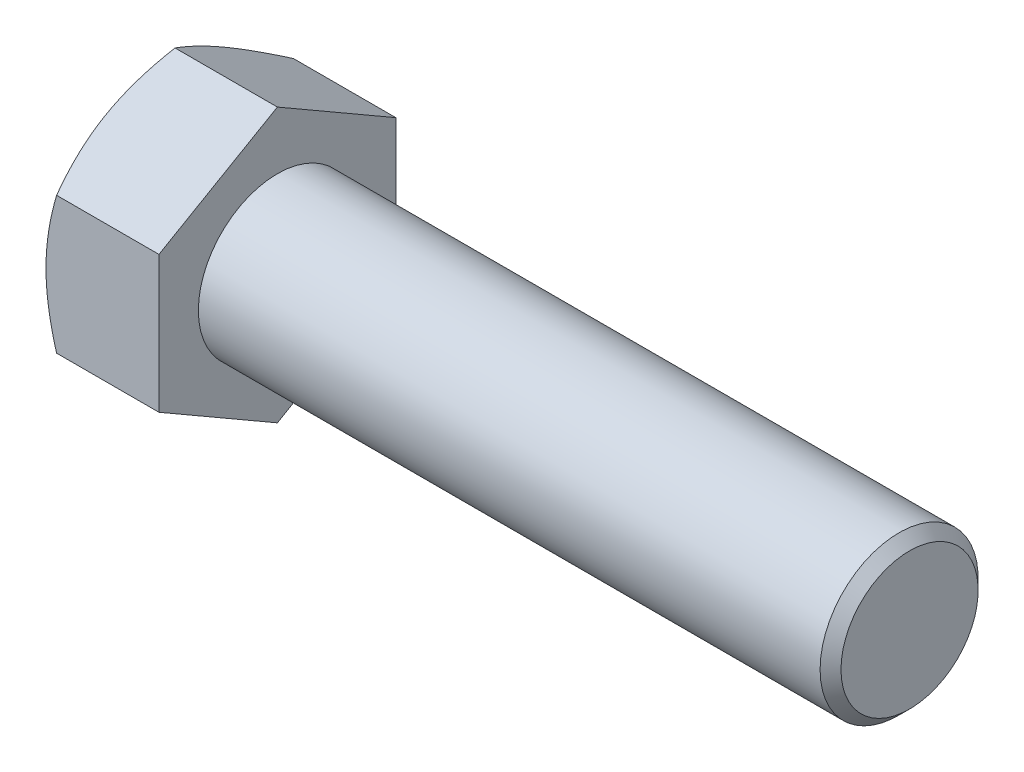
ISO-10303-21;
HEADER;
FILE_DESCRIPTION(('STEP AP214'),'2;1');
FILE_NAME('part.step','',(''),(''),'','','');
FILE_SCHEMA(('AUTOMOTIVE_DESIGN { 1 0 10303 214 1 1 1 1 }'));
ENDSEC;
DATA;
#1=APPLICATION_CONTEXT('core data for automotive mechanical design processes');
#2=APPLICATION_PROTOCOL_DEFINITION('international standard','automotive_design',2000,#1);
#3=PRODUCT_CONTEXT('',#1,'mechanical');
#4=PRODUCT('Part','Part','',(#3));
#5=PRODUCT_RELATED_PRODUCT_CATEGORY('part','',(#4));
#6=PRODUCT_DEFINITION_FORMATION('','',#4);
#7=PRODUCT_DEFINITION_CONTEXT('part definition',#1,'design');
#8=PRODUCT_DEFINITION('design','',#6,#7);
#9=PRODUCT_DEFINITION_SHAPE('','',#8);
#10=(LENGTH_UNIT() NAMED_UNIT(*) SI_UNIT(.MILLI.,.METRE.));
#11=(NAMED_UNIT(*) PLANE_ANGLE_UNIT() SI_UNIT($,.RADIAN.));
#12=(NAMED_UNIT(*) SI_UNIT($,.STERADIAN.) SOLID_ANGLE_UNIT());
#13=UNCERTAINTY_MEASURE_WITH_UNIT(LENGTH_MEASURE(1.E-05),#10,'distance_accuracy_value','');
#14=(GEOMETRIC_REPRESENTATION_CONTEXT(3) GLOBAL_UNCERTAINTY_ASSIGNED_CONTEXT((#13)) GLOBAL_UNIT_ASSIGNED_CONTEXT((#10,
#11,#12)) REPRESENTATION_CONTEXT('',''));
#15=CARTESIAN_POINT('',(0.,0.,0.));
#16=DIRECTION('',(0.,0.,1.));
#17=DIRECTION('',(1.,0.,0.));
#18=AXIS2_PLACEMENT_3D('',#15,#16,#17);
#19=CARTESIAN_POINT('',(6.8072,4.12077981131403,-7.1374));
#20=DIRECTION('',(0.,-0.866025403784438,0.500000000000001));
#21=DIRECTION('',(0.,-0.500000000000001,-0.866025403784438));
#22=AXIS2_PLACEMENT_3D('',#19,#20,#21);
#23=PLANE('',#22);
#24=CARTESIAN_POINT('',(0.637553523420348,8.24167509268191,0.000200000000000209));
#25=CARTESIAN_POINT('',(0.585265389565358,8.15109571898021,-0.15668807736911));
#26=CARTESIAN_POINT('',(0.535350289912886,8.06017862158373,-0.314161109336511));
#27=CARTESIAN_POINT('',(0.44091973939481,7.87760608276958,-0.63038602262945));
#28=CARTESIAN_POINT('',(0.396406617864103,7.78595034088604,-0.789138424377165));
#29=CARTESIAN_POINT('',(0.2718439466046,7.50951559742938,-1.26793744502137));
#30=CARTESIAN_POINT('',(0.200994122533561,7.32364541554993,-1.58987404364865));
#31=CARTESIAN_POINT('',(0.117914357261566,7.04549407114397,-2.07164630435335));
#32=CARTESIAN_POINT('',(0.0942473375753675,6.95404399131371,-2.23004248897558));
#33=CARTESIAN_POINT('',(0.0545611977075645,6.77073061920728,-2.54755056317072));
#34=CARTESIAN_POINT('',(0.0385414017966338,6.67886736416472,-2.70666238825308));
#35=CARTESIAN_POINT('',(0.0145579786669821,6.49498130931768,-3.02516237805154));
#36=CARTESIAN_POINT('',(0.00658520869042847,6.40295880983915,-3.18455002258784));
#37=CARTESIAN_POINT('',(-0.00114175893561545,6.21883388819856,-3.50346374180898));
#38=CARTESIAN_POINT('',(-0.000896210482461237,6.12673146859347,-3.66298981206503));
#39=CARTESIAN_POINT('',(0.0110730517201772,5.87440161908354,-4.10003793168242));
#40=CARTESIAN_POINT('',(0.0311658852990922,5.71425679021456,-4.37741691185292));
#41=CARTESIAN_POINT('',(0.0948800883359065,5.39503079963205,-4.93033254663833));
#42=CARTESIAN_POINT('',(0.13852323430896,5.23595076056063,-5.20586725678008));
#43=CARTESIAN_POINT('',(0.247618299095075,4.91608234409664,-5.75989560583231));
#44=CARTESIAN_POINT('',(0.31353243599271,4.75533432745402,-6.03831933787325));
#45=CARTESIAN_POINT('',(0.463130880450463,4.43623548204411,-6.59101475075978));
#46=CARTESIAN_POINT('',(0.546780048637372,4.27788056676996,-6.86529350964288));
#47=CARTESIAN_POINT('',(0.637553523420342,4.12066434126019,-7.1376));
#48=B_SPLINE_CURVE_WITH_KNOTS('',3,(#24,#25,#26,#27,#28,#29,#30,#31,#32,#33,#34,#35,#36,#37,#38,
#39,#40,#41,#42,#43,#44,#45,#46,#47),.UNSPECIFIED.,.F.,.F.,(4,2,2,2,2,2,2,2,2,2,2,4),(0.,
0.565616271543687,1.13147557690344,2.26554547664276,2.81869146049269,3.37178855781927,
3.9242565351942,4.4767074445971,5.43845614829341,6.40109569003607,7.3850851165131,
8.36714283329691),.UNSPECIFIED.);
#49=CARTESIAN_POINT('',(0.63748685535263,8.24155962262807,0.));
#50=VERTEX_POINT('',#49);
#51=CARTESIAN_POINT('',(0.,6.18116971697105,-3.56870000000001));
#52=VERTEX_POINT('',#51);
#53=EDGE_CURVE('E51',#50,#52,#48,.T.);
#54=ORIENTED_EDGE('',*,*,#53,.F.);
#55=DIRECTION('',(-1.,0.,0.));
#56=VECTOR('',#55,1.);
#57=CARTESIAN_POINT('',(6.8072,8.24155962262807,0.));
#58=LINE('',#57,#56);
#59=CARTESIAN_POINT('',(6.8072,8.24155962262807,0.));
#60=VERTEX_POINT('',#59);
#61=EDGE_CURVE('E147',#60,#50,#58,.T.);
#62=ORIENTED_EDGE('',*,*,#61,.F.);
#63=DIRECTION('',(0.,0.500000000000001,0.866025403784438));
#64=VECTOR('',#63,1.);
#65=CARTESIAN_POINT('',(6.8072,4.12077981131403,-7.1374));
#66=LINE('',#65,#64);
#67=CARTESIAN_POINT('',(6.8072,4.12077981131403,-7.1374));
#68=VERTEX_POINT('',#67);
#69=EDGE_CURVE('E232',#68,#60,#66,.T.);
#70=ORIENTED_EDGE('',*,*,#69,.F.);
#71=DIRECTION('',(-1.,0.,0.));
#72=VECTOR('',#71,1.);
#73=CARTESIAN_POINT('',(6.8072,4.12077981131403,-7.1374));
#74=LINE('',#73,#72);
#75=CARTESIAN_POINT('',(0.637486855352625,4.12077981131403,-7.1374));
#76=VERTEX_POINT('',#75);
#77=EDGE_CURVE('E135',#68,#76,#74,.T.);
#78=ORIENTED_EDGE('',*,*,#77,.T.);
#79=EDGE_CURVE('E129',#52,#76,#48,.T.);
#80=ORIENTED_EDGE('',*,*,#79,.F.);
#81=EDGE_LOOP('',(#54,#62,#70,#78,#80));
#82=FACE_BOUND('',#81,.T.);
#83=ADVANCED_FACE('F35',(#82),#23,.F.);
#84=CARTESIAN_POINT('',(6.8072,8.24155962262807,0.));
#85=DIRECTION('',(0.,-0.866025403784438,-0.500000000000001));
#86=DIRECTION('',(0.,0.500000000000001,-0.866025403784438));
#87=AXIS2_PLACEMENT_3D('',#84,#85,#86);
#88=PLANE('',#87);
#89=CARTESIAN_POINT('',(0.637553523420343,4.12066434126019,7.1376));
#90=CARTESIAN_POINT('',(0.585265389565355,4.21124371496189,6.98071192263089));
#91=CARTESIAN_POINT('',(0.535350289912882,4.30216081235838,6.82323889066349));
#92=CARTESIAN_POINT('',(0.440919739394807,4.48473335117252,6.50701397737055));
#93=CARTESIAN_POINT('',(0.396406617864099,4.57638909305607,6.34826157562283));
#94=CARTESIAN_POINT('',(0.271843946604595,4.85282383651273,5.86946255497863));
#95=CARTESIAN_POINT('',(0.200994122533558,5.03869401839218,5.54752595635135));
#96=CARTESIAN_POINT('',(0.117914357261565,5.31684536279814,5.06575369564664));
#97=CARTESIAN_POINT('',(0.0942473375753663,5.40829544262839,4.90735751102441));
#98=CARTESIAN_POINT('',(0.0545611977075638,5.59160881473483,4.58984943682928));
#99=CARTESIAN_POINT('',(0.0385414017966331,5.68347206977738,4.43073761174692));
#100=CARTESIAN_POINT('',(0.0145579786669819,5.86735812462442,4.11223762194845));
#101=CARTESIAN_POINT('',(0.0065852086904287,5.95938062410296,3.95284997741216));
#102=CARTESIAN_POINT('',(-0.00114175893561467,6.14350554574355,3.63393625819102));
#103=CARTESIAN_POINT('',(-0.000896210482460432,6.23560796534864,3.47441018793497));
#104=CARTESIAN_POINT('',(0.0110730517201783,6.48793781485856,3.03736206831758));
#105=CARTESIAN_POINT('',(0.0311658852990935,6.64808264372754,2.75998308814708));
#106=CARTESIAN_POINT('',(0.094880088335909,6.96730863431005,2.20706745336166));
#107=CARTESIAN_POINT('',(0.138523234308963,7.12638867338148,1.93153274321992));
#108=CARTESIAN_POINT('',(0.247618299095079,7.44625708984546,1.37750439416769));
#109=CARTESIAN_POINT('',(0.313532435992715,7.60700510648809,1.09908066212674));
#110=CARTESIAN_POINT('',(0.463130880450469,7.92610395189799,0.546385249240215));
#111=CARTESIAN_POINT('',(0.546780048637378,8.08445886717215,0.272106490357122));
#112=CARTESIAN_POINT('',(0.637553523420348,8.24167509268191,-0.000199999999999964));
#113=B_SPLINE_CURVE_WITH_KNOTS('',3,(#89,#90,#91,#92,#93,#94,#95,#96,#97,#98,#99,#100,#101,#102,
#103,#104,#105,#106,#107,#108,#109,#110,#111,#112),.UNSPECIFIED.,.F.,.F.,(4,2,2,2,2,2,2,2,2,2,2,
4),(0.,0.565616271543687,1.13147557690344,2.26554547664276,2.81869146049269,3.37178855781927,
3.92425653519419,4.4767074445971,5.4384561482934,6.40109569003607,7.3850851165131,
8.36714283329691),.UNSPECIFIED.);
#114=CARTESIAN_POINT('',(0.637486855352625,4.12077981131403,7.1374));
#115=VERTEX_POINT('',#114);
#116=CARTESIAN_POINT('',(0.,6.18116971697105,3.56870000000001));
#117=VERTEX_POINT('',#116);
#118=EDGE_CURVE('E58',#115,#117,#113,.T.);
#119=ORIENTED_EDGE('',*,*,#118,.F.);
#120=DIRECTION('',(-1.,0.,0.));
#121=VECTOR('',#120,1.);
#122=CARTESIAN_POINT('',(6.8072,4.12077981131403,7.1374));
#123=LINE('',#122,#121);
#124=CARTESIAN_POINT('',(6.8072,4.12077981131403,7.1374));
#125=VERTEX_POINT('',#124);
#126=EDGE_CURVE('E145',#125,#115,#123,.T.);
#127=ORIENTED_EDGE('',*,*,#126,.F.);
#128=DIRECTION('',(0.,-0.500000000000001,0.866025403784438));
#129=VECTOR('',#128,1.);
#130=CARTESIAN_POINT('',(6.8072,8.24155962262807,0.));
#131=LINE('',#130,#129);
#132=EDGE_CURVE('E230',#60,#125,#131,.T.);
#133=ORIENTED_EDGE('',*,*,#132,.F.);
#134=ORIENTED_EDGE('',*,*,#61,.T.);
#135=EDGE_CURVE('E162',#117,#50,#113,.T.);
#136=ORIENTED_EDGE('',*,*,#135,.F.);
#137=EDGE_LOOP('',(#119,#127,#133,#134,#136));
#138=FACE_BOUND('',#137,.T.);
#139=ADVANCED_FACE('F168',(#138),#88,.F.);
#140=CARTESIAN_POINT('',(6.8072,4.12077981131403,7.1374));
#141=DIRECTION('',(0.,0.,-1.));
#142=DIRECTION('',(0.,1.,0.));
#143=AXIS2_PLACEMENT_3D('',#140,#141,#142);
#144=PLANE('',#143);
#145=CARTESIAN_POINT('',(3.51793891529159,-11.1403587281823,7.1374));
#146=CARTESIAN_POINT('',(3.36611761423895,-10.8279722939829,7.1374));
#147=CARTESIAN_POINT('',(3.21573167495453,-10.5148763019502,7.1374));
#148=CARTESIAN_POINT('',(2.91863653187666,-9.88688803381041,7.1374));
#149=CARTESIAN_POINT('',(2.77192789413873,-9.57199549020356,7.1374));
#150=CARTESIAN_POINT('',(2.4822707444374,-8.93844907809395,7.1374));
#151=CARTESIAN_POINT('',(2.33934643073748,-8.61978410832043,7.1374));
#152=CARTESIAN_POINT('',(2.05925336355301,-7.97994405861169,7.1374));
#153=CARTESIAN_POINT('',(1.92208434263963,-7.65876909613177,7.1374));
#154=CARTESIAN_POINT('',(1.65065378260809,-7.00284865177262,7.1374));
#155=CARTESIAN_POINT('',(1.51663374093033,-6.66800268629788,7.1374));
#156=CARTESIAN_POINT('',(1.25856485309991,-5.99442084877243,7.1374));
#157=CARTESIAN_POINT('',(1.13451711552695,-5.65568454901975,7.1374));
#158=CARTESIAN_POINT('',(0.899596727822085,-4.97438980802078,7.1374));
#159=CARTESIAN_POINT('',(0.78869803686409,-4.63184044237924,7.1374));
#160=CARTESIAN_POINT('',(0.583585288687566,-3.94184101149602,7.1374));
#161=CARTESIAN_POINT('',(0.489366053520766,-3.59439250342775,7.1374));
#162=CARTESIAN_POINT('',(0.322585119794827,-2.89623643422075,7.1374));
#163=CARTESIAN_POINT('',(0.249906108269176,-2.54555766857316,7.1374));
#164=CARTESIAN_POINT('',(0.16016292785916,-2.01629019045635,7.1374));
#165=CARTESIAN_POINT('',(0.133459926539481,-1.839313958851,7.1374));
#166=CARTESIAN_POINT('',(0.0870009608477318,-1.48445773915166,7.1374));
#167=CARTESIAN_POINT('',(0.067244323557889,-1.30657784029349,7.1374));
#168=CARTESIAN_POINT('',(0.0353233928543425,-0.95250904258287,7.1374));
#169=CARTESIAN_POINT('',(0.0230620606309571,-0.776328928041973,7.1374));
#170=CARTESIAN_POINT('',(0.00600431658563445,-0.423607840316553,7.1374));
#171=CARTESIAN_POINT('',(0.00120777871187554,-0.247066873275855,7.1374));
#172=CARTESIAN_POINT('',(-0.000805707961562034,0.106061109907499,7.1374));
#173=CARTESIAN_POINT('',(0.00197740746879687,0.2826481264277,7.1374));
#174=CARTESIAN_POINT('',(0.0150543642613307,0.635545980840367,7.1374));
#175=CARTESIAN_POINT('',(0.0253485677574707,0.811856805005951,7.1374));
#176=CARTESIAN_POINT('',(0.0587173547474299,1.23335791950581,7.1374));
#177=CARTESIAN_POINT('',(0.085231710389993,1.4782818359211,7.1374));
#178=CARTESIAN_POINT('',(0.151325349035589,1.96634766571914,7.1374));
#179=CARTESIAN_POINT('',(0.190906343070057,2.20948934145904,7.1374));
#180=CARTESIAN_POINT('',(0.327153349422179,2.9359360870762,7.1374));
#181=CARTESIAN_POINT('',(0.441300495266762,3.41600789567279,7.1374));
#182=CARTESIAN_POINT('',(0.63974010589046,4.13409780442822,7.1374));
#183=CARTESIAN_POINT('',(0.711386839604792,4.37582478040939,7.1374));
#184=CARTESIAN_POINT('',(0.862240727229826,4.85693123571051,7.1374));
#185=CARTESIAN_POINT('',(0.941447936544226,5.09631069781354,7.1374));
#186=CARTESIAN_POINT('',(1.10614180650527,5.57279746366799,7.1374));
#187=CARTESIAN_POINT('',(1.19162653767747,5.80990544046864,7.1374));
#188=CARTESIAN_POINT('',(1.36785754635362,6.28214651213648,7.1374));
#189=CARTESIAN_POINT('',(1.45860372215422,6.51727964507674,7.1374));
#190=CARTESIAN_POINT('',(1.70099135929758,7.12822933761362,7.1374));
#191=CARTESIAN_POINT('',(1.85611245253595,7.50266378774822,7.1374));
#192=CARTESIAN_POINT('',(2.17492034843319,8.24788094351541,7.1374));
#193=CARTESIAN_POINT('',(2.3386079550759,8.61866330249801,7.1374));
#194=CARTESIAN_POINT('',(2.67260301760851,9.3573726984069,7.1374));
#195=CARTESIAN_POINT('',(2.8429126446277,9.72529875060164,7.1374));
#196=CARTESIAN_POINT('',(3.18863367867035,10.4587232716281,7.1374));
#197=CARTESIAN_POINT('',(3.36404491215601,10.8242218225161,7.1374));
#198=CARTESIAN_POINT('',(3.71915496685772,11.5537773356311,7.1374));
#199=CARTESIAN_POINT('',(3.8988595988184,11.9178314638411,7.1374));
#200=CARTESIAN_POINT('',(4.2615056849147,12.6443245258428,7.1374));
#201=CARTESIAN_POINT('',(4.44444716142806,13.006763448446,7.1374));
#202=CARTESIAN_POINT('',(4.81291716824558,13.7302353253808,7.1374));
#203=CARTESIAN_POINT('',(4.99844519887936,14.0912685344906,7.13739999999999));
#204=CARTESIAN_POINT('',(5.3716547110066,14.8122208157994,7.13739999999999));
#205=CARTESIAN_POINT('',(5.55933620097697,15.1721398836055,7.13739999999999));
#206=CARTESIAN_POINT('',(6.08751400336934,16.1789579531885,7.13739999999999));
#207=CARTESIAN_POINT('',(6.43000254426917,16.824811650422,7.13739999999999));
#208=CARTESIAN_POINT('',(7.11919785549648,18.1143032782298,7.13739999999999));
#209=CARTESIAN_POINT('',(7.46590484800224,18.7579410897869,7.13739999999999));
#210=CARTESIAN_POINT('',(8.16140637522349,20.0415314645091,7.13739999999999));
#211=CARTESIAN_POINT('',(8.51019123489486,20.6814892752524,7.13739999999999));
#212=CARTESIAN_POINT('',(9.21019417110812,21.9600146163643,7.13739999999999));
#213=CARTESIAN_POINT('',(9.56141207421098,22.5985822416526,7.13739999999999));
#214=CARTESIAN_POINT('',(9.91351913505246,23.236655568045,7.13739999999999));
#215=B_SPLINE_CURVE_WITH_KNOTS('',3,(#145,#146,#147,#148,#149,#150,#151,#152,#153,#154,#155,
#156,#157,#158,#159,#160,#161,#162,#163,#164,#165,#166,#167,#168,#169,#170,#171,#172,#173,#174,
#175,#176,#177,#178,#179,#180,#181,#182,#183,#184,#185,#186,#187,#188,#189,#190,#191,#192,#193,
#194,#195,#196,#197,#198,#199,#200,#201,#202,#203,#204,#205,#206,#207,#208,#209,#210,#211,#212,
#213,#214),.UNSPECIFIED.,.F.,.F.,(4,2,2,2,2,2,2,2,2,2,2,2,2,2,2,2,2,2,2,2,2,2,2,2,2,2,2,2,2,2,2,
2,2,2,4),(0.,1.04198883636395,2.08413709551114,3.1318378441555,4.17948985568116,
5.26137797327195,6.34338619404597,7.42321445109922,8.50270689759014,9.57620733213103,
10.1130307972433,10.6498022441137,11.1794683960432,11.7091256038406,12.2387872999709,
12.7684745345005,13.507123576735,14.2458693809173,15.7241255464457,16.4804246116249,
17.2367292194423,17.9928023328306,18.7488608362509,19.9645892623299,21.1804319922018,
22.3966767725898,23.6128802291005,24.8308351314584,26.048798457366,27.2665296706471,
28.4842656790576,30.6773737410147,32.8705978143892,35.0570894125082,37.2434267187956),.UNSPECIFIED.);
#216=CARTESIAN_POINT('',(0.637486855352626,-4.12077981131403,7.1374));
#217=VERTEX_POINT('',#216);
#218=CARTESIAN_POINT('',(0.,0.,7.1374));
#219=VERTEX_POINT('',#218);
#220=EDGE_CURVE('E242',#217,#219,#215,.T.);
#221=ORIENTED_EDGE('',*,*,#220,.F.);
#222=DIRECTION('',(-1.,0.,0.));
#223=VECTOR('',#222,1.);
#224=CARTESIAN_POINT('',(6.8072,-4.12077981131403,7.1374));
#225=LINE('',#224,#223);
#226=CARTESIAN_POINT('',(6.8072,-4.12077981131403,7.1374));
#227=VERTEX_POINT('',#226);
#228=EDGE_CURVE('E137',#227,#217,#225,.T.);
#229=ORIENTED_EDGE('',*,*,#228,.F.);
#230=DIRECTION('',(0.,-1.,0.));
#231=VECTOR('',#230,1.);
#232=CARTESIAN_POINT('',(6.8072,4.12077981131403,7.1374));
#233=LINE('',#232,#231);
#234=EDGE_CURVE('E226',#125,#227,#233,.T.);
#235=ORIENTED_EDGE('',*,*,#234,.F.);
#236=ORIENTED_EDGE('',*,*,#126,.T.);
#237=EDGE_CURVE('E184',#219,#115,#215,.T.);
#238=ORIENTED_EDGE('',*,*,#237,.F.);
#239=EDGE_LOOP('',(#221,#229,#235,#236,#238));
#240=FACE_BOUND('',#239,.T.);
#241=ADVANCED_FACE('F248',(#240),#144,.F.);
#242=CARTESIAN_POINT('',(6.8072,-8.24155962262809,0.));
#243=DIRECTION('',(0.,0.866025403784438,-0.500000000000002));
#244=DIRECTION('',(0.,0.500000000000002,0.866025403784438));
#245=AXIS2_PLACEMENT_3D('',#242,#243,#244);
#246=PLANE('',#245);
#247=CARTESIAN_POINT('',(0.637553523420355,-8.24167509268193,-0.000200000000000038));
#248=CARTESIAN_POINT('',(0.585265389565365,-8.15109571898022,0.15668807736911));
#249=CARTESIAN_POINT('',(0.535350289912893,-8.06017862158374,0.314161109336512));
#250=CARTESIAN_POINT('',(0.440919739394817,-7.87760608276959,0.630386022629451));
#251=CARTESIAN_POINT('',(0.396406617864109,-7.78595034088605,0.789138424377166));
#252=CARTESIAN_POINT('',(0.271843946604605,-7.50951559742939,1.26793744502137));
#253=CARTESIAN_POINT('',(0.200994122533566,-7.32364541554994,1.58987404364865));
#254=CARTESIAN_POINT('',(0.117914357261572,-7.04549407114398,2.07164630435336));
#255=CARTESIAN_POINT('',(0.0942473375753728,-6.95404399131372,2.23004248897559));
#256=CARTESIAN_POINT('',(0.0545611977075693,-6.77073061920728,2.54755056317072));
#257=CARTESIAN_POINT('',(0.0385414017966381,-6.67886736416473,2.70666238825308));
#258=CARTESIAN_POINT('',(0.0145579786669859,-6.49498130931769,3.02516237805155));
#259=CARTESIAN_POINT('',(0.00658520869043238,-6.40295880983916,3.18455002258785));
#260=CARTESIAN_POINT('',(-0.00114175893561158,-6.21883388819857,3.50346374180899));
#261=CARTESIAN_POINT('',(-0.000896210482457587,-6.12673146859347,3.66298981206503));
#262=CARTESIAN_POINT('',(0.0110730517201805,-5.87440161908355,4.10003793168243));
#263=CARTESIAN_POINT('',(0.0311658852990955,-5.71425679021457,4.37741691185293));
#264=CARTESIAN_POINT('',(0.0948800883359098,-5.39503079963205,4.93033254663834));
#265=CARTESIAN_POINT('',(0.138523234308963,-5.23595076056063,5.20586725678009));
#266=CARTESIAN_POINT('',(0.247618299095078,-4.91608234409664,5.75989560583231));
#267=CARTESIAN_POINT('',(0.313532435992713,-4.75533432745402,6.03831933787326));
#268=CARTESIAN_POINT('',(0.463130880450465,-4.43623548204411,6.59101475075978));
#269=CARTESIAN_POINT('',(0.546780048637373,-4.27788056676996,6.86529350964288));
#270=CARTESIAN_POINT('',(0.637553523420343,-4.12066434126019,7.1376));
#271=B_SPLINE_CURVE_WITH_KNOTS('',3,(#247,#248,#249,#250,#251,#252,#253,#254,#255,#256,#257,
#258,#259,#260,#261,#262,#263,#264,#265,#266,#267,#268,#269,#270),.UNSPECIFIED.,.F.,.F.,(4,2,2,
2,2,2,2,2,2,2,2,4),(0.,0.565616271543688,1.13147557690344,2.26554547664277,2.81869146049269,
3.37178855781928,3.92425653519421,4.47670744459711,5.43845614829342,6.40109569003608,
7.38508511651311,8.36714283329692),.UNSPECIFIED.);
#272=CARTESIAN_POINT('',(0.637486855352638,-8.24155962262809,0.));
#273=VERTEX_POINT('',#272);
#274=CARTESIAN_POINT('',(0.,-6.18116971697104,3.56870000000001));
#275=VERTEX_POINT('',#274);
#276=EDGE_CURVE('E170',#273,#275,#271,.T.);
#277=ORIENTED_EDGE('',*,*,#276,.F.);
#278=DIRECTION('',(-1.,0.,0.));
#279=VECTOR('',#278,1.);
#280=CARTESIAN_POINT('',(6.8072,-8.24155962262809,0.));
#281=LINE('',#280,#279);
#282=CARTESIAN_POINT('',(6.8072,-8.24155962262809,0.));
#283=VERTEX_POINT('',#282);
#284=EDGE_CURVE('E134',#283,#273,#281,.T.);
#285=ORIENTED_EDGE('',*,*,#284,.F.);
#286=DIRECTION('',(0.,-0.500000000000002,-0.866025403784438));
#287=VECTOR('',#286,1.);
#288=CARTESIAN_POINT('',(6.8072,-8.24155962262809,0.));
#289=LINE('',#288,#287);
#290=EDGE_CURVE('E224',#227,#283,#289,.T.);
#291=ORIENTED_EDGE('',*,*,#290,.F.);
#292=ORIENTED_EDGE('',*,*,#228,.T.);
#293=EDGE_CURVE('E172',#275,#217,#271,.T.);
#294=ORIENTED_EDGE('',*,*,#293,.F.);
#295=EDGE_LOOP('',(#277,#285,#291,#292,#294));
#296=FACE_BOUND('',#295,.T.);
#297=ADVANCED_FACE('F220',(#296),#246,.F.);
#298=CARTESIAN_POINT('',(6.8072,-4.12077981131405,-7.1374));
#299=DIRECTION('',(0.,0.866025403784438,0.500000000000001));
#300=DIRECTION('',(0.,-0.500000000000001,0.866025403784438));
#301=AXIS2_PLACEMENT_3D('',#298,#299,#300);
#302=PLANE('',#301);
#303=CARTESIAN_POINT('',(0.637553523420348,-4.12066434126021,-7.1376));
#304=CARTESIAN_POINT('',(0.585265389565358,-4.21124371496191,-6.98071192263089));
#305=CARTESIAN_POINT('',(0.535350289912886,-4.30216081235839,-6.82323889066349));
#306=CARTESIAN_POINT('',(0.440919739394811,-4.48473335117254,-6.50701397737055));
#307=CARTESIAN_POINT('',(0.396406617864104,-4.57638909305608,-6.34826157562283));
#308=CARTESIAN_POINT('',(0.271843946604602,-4.85282383651274,-5.86946255497863));
#309=CARTESIAN_POINT('',(0.200994122533564,-5.03869401839219,-5.54752595635135));
#310=CARTESIAN_POINT('',(0.117914357261571,-5.31684536279815,-5.06575369564664));
#311=CARTESIAN_POINT('',(0.0942473375753719,-5.4082954426284,-4.90735751102441));
#312=CARTESIAN_POINT('',(0.0545611977075697,-5.59160881473484,-4.58984943682928));
#313=CARTESIAN_POINT('',(0.0385414017966394,-5.6834720697774,-4.43073761174692));
#314=CARTESIAN_POINT('',(0.0145579786669886,-5.86735812462444,-4.11223762194845));
#315=CARTESIAN_POINT('',(0.00658520869043526,-5.95938062410297,-3.95284997741216));
#316=CARTESIAN_POINT('',(-0.00114175893560797,-6.14350554574356,-3.63393625819102));
#317=CARTESIAN_POINT('',(-0.000896210482453403,-6.23560796534865,-3.47441018793497));
#318=CARTESIAN_POINT('',(0.0110730517201859,-6.48793781485857,-3.03736206831757));
#319=CARTESIAN_POINT('',(0.0311658852991012,-6.64808264372756,-2.75998308814708));
#320=CARTESIAN_POINT('',(0.0948800883359163,-6.96730863431007,-2.20706745336166));
#321=CARTESIAN_POINT('',(0.13852323430897,-7.12638867338149,-1.93153274321991));
#322=CARTESIAN_POINT('',(0.247618299095086,-7.44625708984548,-1.37750439416769));
#323=CARTESIAN_POINT('',(0.313532435992722,-7.6070051064881,-1.09908066212674));
#324=CARTESIAN_POINT('',(0.463130880450476,-7.92610395189801,-0.546385249240215));
#325=CARTESIAN_POINT('',(0.546780048637385,-8.08445886717216,-0.272106490357122));
#326=CARTESIAN_POINT('',(0.637553523420355,-8.24167509268193,0.000200000000000375));
#327=B_SPLINE_CURVE_WITH_KNOTS('',3,(#303,#304,#305,#306,#307,#308,#309,#310,#311,#312,#313,
#314,#315,#316,#317,#318,#319,#320,#321,#322,#323,#324,#325,#326),.UNSPECIFIED.,.F.,.F.,(4,2,2,
2,2,2,2,2,2,2,2,4),(0.,0.565616271543687,1.13147557690344,2.26554547664276,2.81869146049269,
3.37178855781927,3.9242565351942,4.47670744459711,5.43845614829341,6.40109569003608,
7.3850851165131,8.36714283329691),.UNSPECIFIED.);
#328=CARTESIAN_POINT('',(0.63748685535263,-4.12077981131405,-7.1374));
#329=VERTEX_POINT('',#328);
#330=CARTESIAN_POINT('',(0.,-6.18116971697105,-3.56870000000001));
#331=VERTEX_POINT('',#330);
#332=EDGE_CURVE('E111',#329,#331,#327,.T.);
#333=ORIENTED_EDGE('',*,*,#332,.F.);
#334=DIRECTION('',(-1.,0.,0.));
#335=VECTOR('',#334,1.);
#336=CARTESIAN_POINT('',(6.8072,-4.12077981131405,-7.1374));
#337=LINE('',#336,#335);
#338=CARTESIAN_POINT('',(6.8072,-4.12077981131405,-7.1374));
#339=VERTEX_POINT('',#338);
#340=EDGE_CURVE('E125',#339,#329,#337,.T.);
#341=ORIENTED_EDGE('',*,*,#340,.F.);
#342=DIRECTION('',(0.,0.500000000000001,-0.866025403784438));
#343=VECTOR('',#342,1.);
#344=CARTESIAN_POINT('',(6.8072,-4.12077981131405,-7.1374));
#345=LINE('',#344,#343);
#346=EDGE_CURVE('E222',#283,#339,#345,.T.);
#347=ORIENTED_EDGE('',*,*,#346,.F.);
#348=ORIENTED_EDGE('',*,*,#284,.T.);
#349=EDGE_CURVE('E128',#331,#273,#327,.T.);
#350=ORIENTED_EDGE('',*,*,#349,.F.);
#351=EDGE_LOOP('',(#333,#341,#347,#348,#350));
#352=FACE_BOUND('',#351,.T.);
#353=ADVANCED_FACE('F123',(#352),#302,.F.);
#354=CARTESIAN_POINT('',(6.8072,4.12077981131403,-7.1374));
#355=DIRECTION('',(0.,0.,1.));
#356=DIRECTION('',(1.,0.,0.));
#357=AXIS2_PLACEMENT_3D('',#354,#355,#356);
#358=PLANE('',#357);
#359=CARTESIAN_POINT('',(3.51793891464088,-11.1403587268438,-7.1374));
#360=CARTESIAN_POINT('',(3.36611761361543,-10.8279722926893,-7.1374));
#361=CARTESIAN_POINT('',(3.21573167435818,-10.5148763007017,-7.1374));
#362=CARTESIAN_POINT('',(2.91863653133453,-9.88688803265221,-7.1374));
#363=CARTESIAN_POINT('',(2.77192789362365,-9.57199548909056,-7.1374));
#364=CARTESIAN_POINT('',(2.48227074397642,-8.93844907707205,-7.1374));
#365=CARTESIAN_POINT('',(2.33934643030356,-8.61978410734443,-7.1374));
#366=CARTESIAN_POINT('',(2.05925336317276,-7.97994405772781,-7.1374));
#367=CARTESIAN_POINT('',(1.92208434228598,-7.65876909529411,-7.1374));
#368=CARTESIAN_POINT('',(1.65065378230838,-7.00284865103087,-7.1374));
#369=CARTESIAN_POINT('',(1.51663374065788,-6.66800268560586,-7.1374));
#370=CARTESIAN_POINT('',(1.25856485288052,-5.99442084818067,-7.1374));
#371=CARTESIAN_POINT('',(1.13451711533335,-5.65568454847852,-7.1374));
#372=CARTESIAN_POINT('',(0.899596727677598,-4.97438980758157,-7.1374));
#373=CARTESIAN_POINT('',(0.788698036742925,-4.6318404419915,-7.1374));
#374=CARTESIAN_POINT('',(0.58358528860922,-3.94184101121262,-7.1374));
#375=CARTESIAN_POINT('',(0.489366053461919,-3.59439250319721,-7.1374));
#376=CARTESIAN_POINT('',(0.322585119775293,-2.8962364341233,-7.1374));
#377=CARTESIAN_POINT('',(0.249906108267926,-2.54555766855629,-7.1374));
#378=CARTESIAN_POINT('',(0.160162927876228,-2.01629019056176,-7.1374));
#379=CARTESIAN_POINT('',(0.133459926561136,-1.8393139589974,-7.1374));
#380=CARTESIAN_POINT('',(0.0870009608751871,-1.48445773938036,-7.1374));
#381=CARTESIAN_POINT('',(0.0672443235865587,-1.30657784056351,-7.1374));
#382=CARTESIAN_POINT('',(0.0353233928817916,-0.952509042934685,-7.1374));
#383=CARTESIAN_POINT('',(0.0230620606560368,-0.776328928434256,-7.1374));
#384=CARTESIAN_POINT('',(0.00600431660240766,-0.423607840789684,-7.1374));
#385=CARTESIAN_POINT('',(0.00120777872271161,-0.247066873789368,-7.1374));
#386=CARTESIAN_POINT('',(-0.000805707966081502,0.106061109313529,-7.1374));
#387=CARTESIAN_POINT('',(0.0019774074548583,0.282648125793653,-7.1374));
#388=CARTESIAN_POINT('',(0.0150543642253239,0.635545980126694,-7.1374));
#389=CARTESIAN_POINT('',(0.0253485677088145,0.811856804252727,-7.1374));
#390=CARTESIAN_POINT('',(0.0587173546676609,1.23335791869125,-7.1374));
#391=CARTESIAN_POINT('',(0.0852317102922971,1.47828183508493,-7.1374));
#392=CARTESIAN_POINT('',(0.151325348901076,1.96634766484072,-7.1374));
#393=CARTESIAN_POINT('',(0.190906342916654,2.20948934055998,-7.1374));
#394=CARTESIAN_POINT('',(0.327153349211703,2.93593608611633,-7.1374));
#395=CARTESIAN_POINT('',(0.441300495017728,3.41600789467395,-7.1374));
#396=CARTESIAN_POINT('',(0.639740105584508,4.13409780337109,-7.1374));
#397=CARTESIAN_POINT('',(0.711386839279734,4.37582477933241,-7.1374));
#398=CARTESIAN_POINT('',(0.862240726867132,4.85693123459406,-7.1374));
#399=CARTESIAN_POINT('',(0.941447936163,5.09631069667747,-7.1374));
#400=CARTESIAN_POINT('',(1.10614180608763,5.57279746249282,-7.1374));
#401=CARTESIAN_POINT('',(1.19162653724196,5.80990543927398,-7.1374));
#402=CARTESIAN_POINT('',(1.36785754588296,6.28214651090285,-7.1374));
#403=CARTESIAN_POINT('',(1.4586037216663,6.51727964382363,-7.1374));
#404=CARTESIAN_POINT('',(1.70099135878085,7.1282293363487,-7.1374));
#405=CARTESIAN_POINT('',(1.85611245200931,7.50266378649047,-7.1374));
#406=CARTESIAN_POINT('',(2.17492034788946,8.2478809422711,-7.1374));
#407=CARTESIAN_POINT('',(2.33860795452499,8.61866330125997,-7.1374));
#408=CARTESIAN_POINT('',(2.67260301704526,9.35737269718074,-7.1374));
#409=CARTESIAN_POINT('',(2.8429126440593,9.72529874938109,-7.1374));
#410=CARTESIAN_POINT('',(3.18863367809308,10.4587232704181,-7.1374));
#411=CARTESIAN_POINT('',(3.36404491157502,10.8242218213112,-7.1374));
#412=CARTESIAN_POINT('',(3.7191549662705,11.553777334436,-7.1374));
#413=CARTESIAN_POINT('',(3.89885959822867,11.9178314626509,-7.1374));
#414=CARTESIAN_POINT('',(4.26150568432078,12.6443245246618,-7.1374));
#415=CARTESIAN_POINT('',(4.44444716083244,13.0067634472695,-7.1374));
#416=CARTESIAN_POINT('',(4.81291716764717,13.7302353242129,-7.1374));
#417=CARTESIAN_POINT('',(4.99844519827985,14.0912685333268,-7.1374));
#418=CARTESIAN_POINT('',(5.37165471040538,14.8122208146436,-7.1374));
#419=CARTESIAN_POINT('',(5.55933620037513,15.1721398824536,-7.1374));
#420=CARTESIAN_POINT('',(6.08751400276292,16.1789579520409,-7.1374));
#421=CARTESIAN_POINT('',(6.43000254365915,16.8248116492745,-7.1374));
#422=CARTESIAN_POINT('',(7.11919785487999,18.1143032770824,-7.1374));
#423=CARTESIAN_POINT('',(7.46590484738288,18.7579410886393,-7.1374));
#424=CARTESIAN_POINT('',(8.16140637459832,20.0415314633598,-7.1374));
#425=CARTESIAN_POINT('',(8.51019123426675,20.6814892741017,-7.1374));
#426=CARTESIAN_POINT('',(9.21019417047446,21.9600146152104,-7.1374));
#427=CARTESIAN_POINT('',(9.56141207357472,22.598582240497,-7.1374));
#428=CARTESIAN_POINT('',(9.9135191344137,23.2366555668876,-7.1374));
#429=B_SPLINE_CURVE_WITH_KNOTS('',3,(#359,#360,#361,#362,#363,#364,#365,#366,#367,#368,#369,
#370,#371,#372,#373,#374,#375,#376,#377,#378,#379,#380,#381,#382,#383,#384,#385,#386,#387,#388,
#389,#390,#391,#392,#393,#394,#395,#396,#397,#398,#399,#400,#401,#402,#403,#404,#405,#406,#407,
#408,#409,#410,#411,#412,#413,#414,#415,#416,#417,#418,#419,#420,#421,#422,#423,#424,#425,#426,
#427,#428),.UNSPECIFIED.,.F.,.F.,(4,2,2,2,2,2,2,2,2,2,2,2,2,2,2,2,2,2,2,2,2,2,2,2,2,2,2,2,2,2,2,
2,2,2,4),(0.,1.0419888362068,2.08413709519682,3.13183784368231,4.17948985504911,
5.26137797247103,6.34338619307611,7.42321444996099,8.50270689628369,9.57620733057733,
10.113030795566,10.6498022423129,11.179468394122,11.7091256017988,12.2387872978086,
12.7684745322176,13.507123574382,14.245869378494,15.7241255438818,16.4804246089875,
17.2367292167316,17.9928023300467,18.7488608333938,19.9645892594812,21.1804319893616,
22.3966767697582,23.6128802262777,24.8308351286452,26.0487984545625,27.2665296678531,
28.4842656762731,30.6773737382256,32.8705978115956,35.0570894097065,37.2434267159856),.UNSPECIFIED.);
#430=CARTESIAN_POINT('',(0.,0.,-7.1374));
#431=VERTEX_POINT('',#430);
#432=EDGE_CURVE('E117',#76,#431,#429,.F.);
#433=ORIENTED_EDGE('',*,*,#432,.F.);
#434=ORIENTED_EDGE('',*,*,#77,.F.);
#435=DIRECTION('',(0.,1.,0.));
#436=VECTOR('',#435,1.);
#437=CARTESIAN_POINT('',(6.8072,4.12077981131403,-7.1374));
#438=LINE('',#437,#436);
#439=EDGE_CURVE('E133',#339,#68,#438,.T.);
#440=ORIENTED_EDGE('',*,*,#439,.F.);
#441=ORIENTED_EDGE('',*,*,#340,.T.);
#442=EDGE_CURVE('E108',#431,#329,#429,.F.);
#443=ORIENTED_EDGE('',*,*,#442,.F.);
#444=EDGE_LOOP('',(#433,#434,#440,#441,#443));
#445=FACE_BOUND('',#444,.T.);
#446=ADVANCED_FACE('F131',(#445),#358,.F.);
#447=CARTESIAN_POINT('',(6.8072,8.24155962262808,0.));
#448=DIRECTION('',(1.,0.,0.));
#449=DIRECTION('',(0.,0.,-1.));
#450=AXIS2_PLACEMENT_3D('',#447,#448,#449);
#451=PLANE('',#450);
#452=ORIENTED_EDGE('',*,*,#69,.T.);
#453=ORIENTED_EDGE('',*,*,#132,.T.);
#454=ORIENTED_EDGE('',*,*,#234,.T.);
#455=ORIENTED_EDGE('',*,*,#290,.T.);
#456=ORIENTED_EDGE('',*,*,#346,.T.);
#457=ORIENTED_EDGE('',*,*,#439,.T.);
#458=EDGE_LOOP('',(#452,#453,#454,#455,#456,#457));
#459=FACE_BOUND('',#458,.T.);
#460=CARTESIAN_POINT('',(6.8072,0.,0.));
#461=DIRECTION('',(1.,0.,0.));
#462=DIRECTION('',(0.,0.,-1.));
#463=AXIS2_PLACEMENT_3D('',#460,#461,#462);
#464=CIRCLE('',#463,4.7625);
#465=CARTESIAN_POINT('',(6.8072,0.,-4.7625));
#466=VERTEX_POINT('',#465);
#467=EDGE_CURVE('E235',#466,#466,#464,.F.);
#468=ORIENTED_EDGE('',*,*,#467,.T.);
#469=EDGE_LOOP('',(#468));
#470=FACE_BOUND('',#469,.T.);
#471=ADVANCED_FACE('F250',(#459,#470),#451,.T.);
#472=CARTESIAN_POINT('',(0.,0.,0.));
#473=DIRECTION('',(-1.,0.,0.));
#474=DIRECTION('',(0.,0.,1.));
#475=AXIS2_PLACEMENT_3D('',#472,#473,#474);
#476=CYLINDRICAL_SURFACE('',#475,4.7625);
#477=ORIENTED_EDGE('',*,*,#467,.F.);
#478=EDGE_LOOP('',(#477));
#479=FACE_BOUND('',#478,.T.);
#480=CARTESIAN_POINT('',(44.27728,0.,0.));
#481=DIRECTION('',(-1.,0.,0.));
#482=DIRECTION('',(0.,0.,1.));
#483=AXIS2_PLACEMENT_3D('',#480,#481,#482);
#484=CIRCLE('',#483,4.7625);
#485=CARTESIAN_POINT('',(44.27728,0.,4.7625));
#486=VERTEX_POINT('',#485);
#487=EDGE_CURVE('E238',#486,#486,#484,.T.);
#488=ORIENTED_EDGE('',*,*,#487,.T.);
#489=EDGE_LOOP('',(#488));
#490=FACE_BOUND('',#489,.T.);
#491=ADVANCED_FACE('F282',(#479,#490),#476,.T.);
#492=CARTESIAN_POINT('',(44.9072,0.,0.));
#493=DIRECTION('',(-1.,0.,0.));
#494=DIRECTION('',(0.,0.,1.));
#495=AXIS2_PLACEMENT_3D('',#492,#493,#494);
#496=CONICAL_SURFACE('',#495,4.13258,0.785398163397448);
#497=ORIENTED_EDGE('',*,*,#487,.F.);
#498=EDGE_LOOP('',(#497));
#499=FACE_BOUND('',#498,.T.);
#500=CARTESIAN_POINT('',(44.9072,0.,0.));
#501=DIRECTION('',(-1.,0.,0.));
#502=DIRECTION('',(0.,0.,1.));
#503=AXIS2_PLACEMENT_3D('',#500,#501,#502);
#504=CIRCLE('',#503,4.13258);
#505=CARTESIAN_POINT('',(44.9072,0.,4.13258));
#506=VERTEX_POINT('',#505);
#507=EDGE_CURVE('E240',#506,#506,#504,.T.);
#508=ORIENTED_EDGE('',*,*,#507,.T.);
#509=EDGE_LOOP('',(#508));
#510=FACE_BOUND('',#509,.T.);
#511=ADVANCED_FACE('F284',(#499,#510),#496,.T.);
#512=CARTESIAN_POINT('',(44.9072,0.,0.));
#513=DIRECTION('',(-1.,0.,0.));
#514=DIRECTION('',(0.,0.,1.));
#515=AXIS2_PLACEMENT_3D('',#512,#513,#514);
#516=PLANE('',#515);
#517=ORIENTED_EDGE('',*,*,#507,.F.);
#518=EDGE_LOOP('',(#517));
#519=FACE_BOUND('',#518,.T.);
#520=ADVANCED_FACE('F197',(#519),#516,.F.);
#521=CARTESIAN_POINT('',(0.,0.,0.));
#522=DIRECTION('',(1.,0.,0.));
#523=DIRECTION('',(0.,0.,-1.));
#524=AXIS2_PLACEMENT_3D('',#521,#522,#523);
#525=CONICAL_SURFACE('',#524,7.1374,1.0471975511966);
#526=ORIENTED_EDGE('',*,*,#332,.T.);
#527=CARTESIAN_POINT('',(0.,0.,0.));
#528=DIRECTION('',(1.,0.,0.));
#529=DIRECTION('',(0.,0.,-1.));
#530=AXIS2_PLACEMENT_3D('',#527,#528,#529);
#531=CIRCLE('',#530,7.1374);
#532=EDGE_CURVE('E39',#331,#431,#531,.T.);
#533=ORIENTED_EDGE('',*,*,#532,.T.);
#534=ORIENTED_EDGE('',*,*,#442,.T.);
#535=EDGE_LOOP('',(#526,#533,#534));
#536=FACE_BOUND('',#535,.T.);
#537=ADVANCED_FACE('F110',(#536),#525,.T.);
#538=ORIENTED_EDGE('',*,*,#276,.T.);
#539=EDGE_CURVE('E152',#275,#331,#531,.T.);
#540=ORIENTED_EDGE('',*,*,#539,.T.);
#541=ORIENTED_EDGE('',*,*,#349,.T.);
#542=EDGE_LOOP('',(#538,#540,#541));
#543=FACE_BOUND('',#542,.T.);
#544=ADVANCED_FACE('F196',(#543),#525,.T.);
#545=ORIENTED_EDGE('',*,*,#220,.T.);
#546=EDGE_CURVE('E153',#219,#275,#531,.T.);
#547=ORIENTED_EDGE('',*,*,#546,.T.);
#548=ORIENTED_EDGE('',*,*,#293,.T.);
#549=EDGE_LOOP('',(#545,#547,#548));
#550=FACE_BOUND('',#549,.T.);
#551=ADVANCED_FACE('F191',(#550),#525,.T.);
#552=ORIENTED_EDGE('',*,*,#237,.T.);
#553=ORIENTED_EDGE('',*,*,#118,.T.);
#554=CARTESIAN_POINT('',(0.,0.,0.));
#555=DIRECTION('',(-1.,0.,0.));
#556=DIRECTION('',(0.,0.,1.));
#557=AXIS2_PLACEMENT_3D('',#554,#555,#556);
#558=CIRCLE('',#557,7.1374);
#559=EDGE_CURVE('E118',#219,#117,#558,.T.);
#560=ORIENTED_EDGE('',*,*,#559,.F.);
#561=EDGE_LOOP('',(#552,#553,#560));
#562=FACE_BOUND('',#561,.T.);
#563=ADVANCED_FACE('F195',(#562),#525,.T.);
#564=ORIENTED_EDGE('',*,*,#135,.T.);
#565=ORIENTED_EDGE('',*,*,#53,.T.);
#566=EDGE_CURVE('E44',#52,#117,#531,.T.);
#567=ORIENTED_EDGE('',*,*,#566,.T.);
#568=EDGE_LOOP('',(#564,#565,#567));
#569=FACE_BOUND('',#568,.T.);
#570=ADVANCED_FACE('F161',(#569),#525,.T.);
#571=ORIENTED_EDGE('',*,*,#79,.T.);
#572=ORIENTED_EDGE('',*,*,#432,.T.);
#573=EDGE_CURVE('E11',#431,#52,#531,.T.);
#574=ORIENTED_EDGE('',*,*,#573,.T.);
#575=EDGE_LOOP('',(#571,#572,#574));
#576=FACE_BOUND('',#575,.T.);
#577=ADVANCED_FACE('F254',(#576),#525,.T.);
#578=CARTESIAN_POINT('',(0.,8.24155962262808,0.));
#579=DIRECTION('',(1.,0.,0.));
#580=DIRECTION('',(0.,0.,-1.));
#581=AXIS2_PLACEMENT_3D('',#578,#579,#580);
#582=PLANE('',#581);
#583=ORIENTED_EDGE('',*,*,#573,.F.);
#584=ORIENTED_EDGE('',*,*,#532,.F.);
#585=ORIENTED_EDGE('',*,*,#539,.F.);
#586=ORIENTED_EDGE('',*,*,#546,.F.);
#587=ORIENTED_EDGE('',*,*,#559,.T.);
#588=ORIENTED_EDGE('',*,*,#566,.F.);
#589=EDGE_LOOP('',(#583,#584,#585,#586,#587,#588));
#590=FACE_BOUND('',#589,.T.);
#591=ADVANCED_FACE('F165',(#590),#582,.F.);
#592=CLOSED_SHELL('',(#83,#139,#241,#297,#353,#446,#471,#491,#511,#520,#537,#544,#551,#563,#570,
#577,#591));
#593=MANIFOLD_SOLID_BREP('B2',#592);
#594=ADVANCED_BREP_SHAPE_REPRESENTATION('',(#18,#593),#14);
#595=SHAPE_DEFINITION_REPRESENTATION(#9,#594);
ENDSEC;
END-ISO-10303-21;
